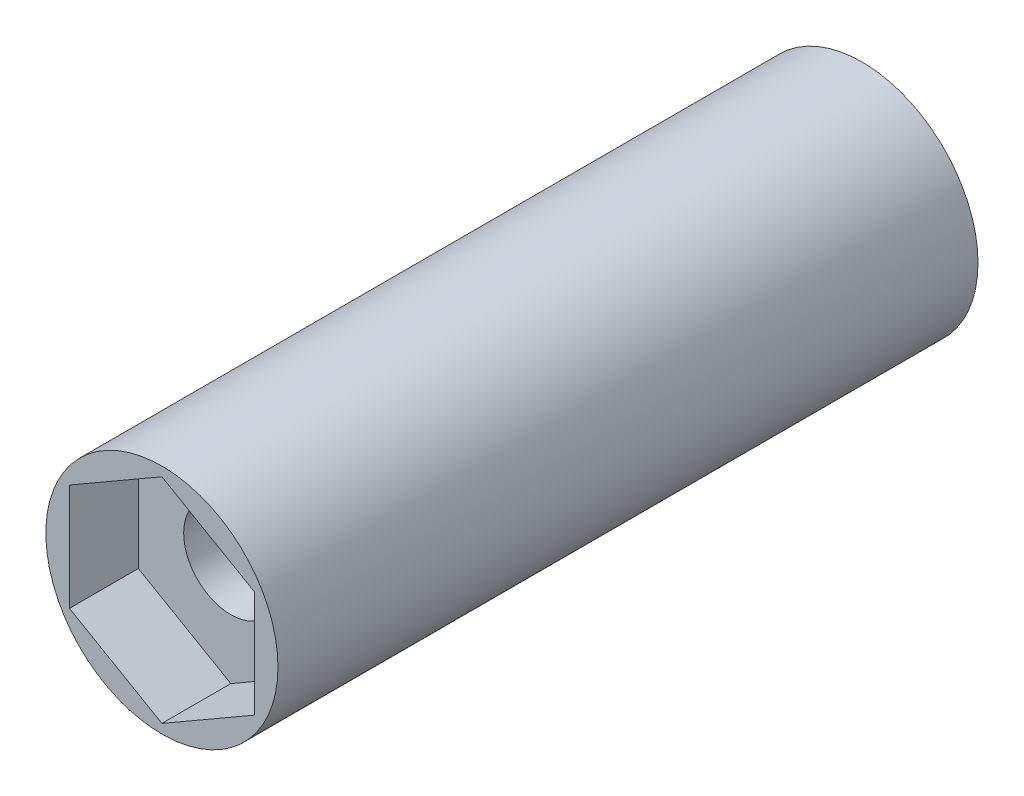
ISO-10303-21;
HEADER;
FILE_DESCRIPTION(('STEP AP214'),'2;1');
FILE_NAME('part.step','',(''),(''),'','','');
FILE_SCHEMA(('AUTOMOTIVE_DESIGN { 1 0 10303 214 1 1 1 1 }'));
ENDSEC;
DATA;
#1=APPLICATION_CONTEXT('core data for automotive mechanical design processes');
#2=APPLICATION_PROTOCOL_DEFINITION('international standard','automotive_design',2000,#1);
#3=PRODUCT_CONTEXT('',#1,'mechanical');
#4=PRODUCT('Part','Part','',(#3));
#5=PRODUCT_RELATED_PRODUCT_CATEGORY('part','',(#4));
#6=PRODUCT_DEFINITION_FORMATION('','',#4);
#7=PRODUCT_DEFINITION_CONTEXT('part definition',#1,'design');
#8=PRODUCT_DEFINITION('design','',#6,#7);
#9=PRODUCT_DEFINITION_SHAPE('','',#8);
#10=(LENGTH_UNIT() NAMED_UNIT(*) SI_UNIT(.MILLI.,.METRE.));
#11=(NAMED_UNIT(*) PLANE_ANGLE_UNIT() SI_UNIT($,.RADIAN.));
#12=(NAMED_UNIT(*) SI_UNIT($,.STERADIAN.) SOLID_ANGLE_UNIT());
#13=UNCERTAINTY_MEASURE_WITH_UNIT(LENGTH_MEASURE(1.E-05),#10,'distance_accuracy_value','');
#14=(GEOMETRIC_REPRESENTATION_CONTEXT(3) GLOBAL_UNCERTAINTY_ASSIGNED_CONTEXT((#13)) GLOBAL_UNIT_ASSIGNED_CONTEXT((#10,
#11,#12)) REPRESENTATION_CONTEXT('',''));
#15=CARTESIAN_POINT('',(0.,0.,0.));
#16=DIRECTION('',(0.,0.,1.));
#17=DIRECTION('',(1.,0.,0.));
#18=AXIS2_PLACEMENT_3D('',#15,#16,#17);
#19=CARTESIAN_POINT('',(-32.2,44.45,26.4509667991878));
#20=DIRECTION('',(0.,0.,-1.));
#21=DIRECTION('',(-1.,0.,0.));
#22=AXIS2_PLACEMENT_3D('',#19,#20,#21);
#23=CYLINDRICAL_SURFACE('',#22,1.3);
#24=CARTESIAN_POINT('',(-32.2,44.45,17.4));
#25=DIRECTION('',(0.,0.,1.));
#26=DIRECTION('',(1.,0.,0.));
#27=AXIS2_PLACEMENT_3D('',#24,#25,#26);
#28=CIRCLE('',#27,1.3);
#29=CARTESIAN_POINT('',(-30.9,44.45,17.4));
#30=VERTEX_POINT('',#29);
#31=EDGE_CURVE('E128',#30,#30,#28,.T.);
#32=ORIENTED_EDGE('',*,*,#31,.T.);
#33=EDGE_LOOP('',(#32));
#34=FACE_BOUND('',#33,.T.);
#35=CARTESIAN_POINT('',(-32.2,44.45,2.4));
#36=DIRECTION('',(0.,0.,-1.));
#37=DIRECTION('',(-1.,0.,0.));
#38=AXIS2_PLACEMENT_3D('',#35,#36,#37);
#39=CIRCLE('',#38,1.3);
#40=CARTESIAN_POINT('',(-33.5,44.45,2.4));
#41=VERTEX_POINT('',#40);
#42=EDGE_CURVE('E110',#41,#41,#39,.T.);
#43=ORIENTED_EDGE('',*,*,#42,.T.);
#44=EDGE_LOOP('',(#43));
#45=FACE_BOUND('',#44,.T.);
#46=ADVANCED_FACE('F37',(#34,#45),#23,.F.);
#47=CARTESIAN_POINT('',(-32.2,44.45,0.));
#48=DIRECTION('',(0.,0.,1.));
#49=DIRECTION('',(1.,0.,0.));
#50=AXIS2_PLACEMENT_3D('',#47,#48,#49);
#51=PLANE('',#50);
#52=CARTESIAN_POINT('',(-32.2,44.45,0.));
#53=DIRECTION('',(0.,0.,1.));
#54=DIRECTION('',(1.,0.,0.));
#55=AXIS2_PLACEMENT_3D('',#52,#53,#54);
#56=CIRCLE('',#55,3.2);
#57=CARTESIAN_POINT('',(-29.,44.45,0.));
#58=VERTEX_POINT('',#57);
#59=EDGE_CURVE('E11',#58,#58,#56,.T.);
#60=ORIENTED_EDGE('',*,*,#59,.F.);
#61=EDGE_LOOP('',(#60));
#62=FACE_BOUND('',#61,.T.);
#63=CARTESIAN_POINT('',(-32.2,44.45,0.));
#64=DIRECTION('',(0.,0.,1.));
#65=DIRECTION('',(1.,0.,0.));
#66=AXIS2_PLACEMENT_3D('',#63,#64,#65);
#67=CIRCLE('',#66,2.92901631902917);
#68=CARTESIAN_POINT('',(-29.2709836809709,44.45,0.));
#69=VERTEX_POINT('',#68);
#70=EDGE_CURVE('E45',#69,#69,#67,.T.);
#71=ORIENTED_EDGE('',*,*,#70,.T.);
#72=EDGE_LOOP('',(#71));
#73=FACE_BOUND('',#72,.T.);
#74=ADVANCED_FACE('F136',(#62,#73),#51,.F.);
#75=CARTESIAN_POINT('',(-32.2,44.45,2.2));
#76=DIRECTION('',(0.,0.,-1.));
#77=DIRECTION('',(-1.,0.,0.));
#78=AXIS2_PLACEMENT_3D('',#75,#76,#77);
#79=CYLINDRICAL_SURFACE('',#78,3.2);
#80=ORIENTED_EDGE('',*,*,#59,.T.);
#81=EDGE_LOOP('',(#80));
#82=FACE_BOUND('',#81,.T.);
#83=CARTESIAN_POINT('',(-32.2,44.45,19.3));
#84=DIRECTION('',(0.,0.,1.));
#85=DIRECTION('',(1.,0.,0.));
#86=AXIS2_PLACEMENT_3D('',#83,#84,#85);
#87=CIRCLE('',#86,3.2);
#88=CARTESIAN_POINT('',(-29.,44.45,19.3));
#89=VERTEX_POINT('',#88);
#90=EDGE_CURVE('E100',#89,#89,#87,.T.);
#91=ORIENTED_EDGE('',*,*,#90,.F.);
#92=EDGE_LOOP('',(#91));
#93=FACE_BOUND('',#92,.T.);
#94=ADVANCED_FACE('F39',(#82,#93),#79,.T.);
#95=CARTESIAN_POINT('',(-32.2,44.45,2.2));
#96=DIRECTION('',(0.,0.,-1.));
#97=DIRECTION('',(-1.,0.,0.));
#98=AXIS2_PLACEMENT_3D('',#95,#96,#97);
#99=CYLINDRICAL_SURFACE('',#98,2.92901631902917);
#100=CARTESIAN_POINT('',(-32.2,44.45,2.2));
#101=DIRECTION('',(0.,0.,1.));
#102=DIRECTION('',(1.,0.,0.));
#103=AXIS2_PLACEMENT_3D('',#100,#101,#102);
#104=CIRCLE('',#103,2.92901631902917);
#105=CARTESIAN_POINT('',(-29.2709836809709,44.45,2.2));
#106=VERTEX_POINT('',#105);
#107=EDGE_CURVE('E131',#106,#106,#104,.T.);
#108=ORIENTED_EDGE('',*,*,#107,.T.);
#109=EDGE_LOOP('',(#108));
#110=FACE_BOUND('',#109,.T.);
#111=ORIENTED_EDGE('',*,*,#70,.F.);
#112=EDGE_LOOP('',(#111));
#113=FACE_BOUND('',#112,.T.);
#114=ADVANCED_FACE('F138',(#110,#113),#99,.F.);
#115=CARTESIAN_POINT('',(-32.2,44.45,2.2));
#116=DIRECTION('',(0.,0.,1.));
#117=DIRECTION('',(1.,0.,0.));
#118=AXIS2_PLACEMENT_3D('',#115,#116,#117);
#119=PLANE('',#118);
#120=ORIENTED_EDGE('',*,*,#107,.F.);
#121=EDGE_LOOP('',(#120));
#122=FACE_BOUND('',#121,.T.);
#123=ADVANCED_FACE('F140',(#122),#119,.F.);
#124=CARTESIAN_POINT('',(-32.2,44.45,17.4));
#125=DIRECTION('',(0.,0.,1.));
#126=DIRECTION('',(0.,-1.,0.));
#127=AXIS2_PLACEMENT_3D('',#124,#125,#126);
#128=PLANE('',#127);
#129=DIRECTION('',(-0.866025403784438,-0.500000000000002,0.));
#130=VECTOR('',#129,1.);
#131=CARTESIAN_POINT('',(-32.2,47.3944863728671,17.4));
#132=LINE('',#131,#130);
#133=CARTESIAN_POINT('',(-32.2,47.3944863728671,17.4));
#134=VERTEX_POINT('',#133);
#135=CARTESIAN_POINT('',(-34.75,45.9222431864335,17.4));
#136=VERTEX_POINT('',#135);
#137=EDGE_CURVE('E113',#134,#136,#132,.T.);
#138=ORIENTED_EDGE('',*,*,#137,.T.);
#139=DIRECTION('',(0.,-1.,0.));
#140=VECTOR('',#139,1.);
#141=CARTESIAN_POINT('',(-34.75,45.9222431864335,17.4));
#142=LINE('',#141,#140);
#143=CARTESIAN_POINT('',(-34.75,42.9777568135665,17.4));
#144=VERTEX_POINT('',#143);
#145=EDGE_CURVE('E203',#136,#144,#142,.T.);
#146=ORIENTED_EDGE('',*,*,#145,.T.);
#147=DIRECTION('',(0.866025403784438,-0.500000000000002,0.));
#148=VECTOR('',#147,1.);
#149=CARTESIAN_POINT('',(-34.75,42.9777568135665,17.4));
#150=LINE('',#149,#148);
#151=CARTESIAN_POINT('',(-32.2,41.5055136271329,17.4));
#152=VERTEX_POINT('',#151);
#153=EDGE_CURVE('E207',#144,#152,#150,.T.);
#154=ORIENTED_EDGE('',*,*,#153,.T.);
#155=DIRECTION('',(0.866025403784438,0.5,0.));
#156=VECTOR('',#155,1.);
#157=CARTESIAN_POINT('',(-32.2,41.5055136271329,17.4));
#158=LINE('',#157,#156);
#159=CARTESIAN_POINT('',(-29.65,42.9777568135665,17.4));
#160=VERTEX_POINT('',#159);
#161=EDGE_CURVE('E209',#152,#160,#158,.T.);
#162=ORIENTED_EDGE('',*,*,#161,.T.);
#163=DIRECTION('',(0.,1.,0.));
#164=VECTOR('',#163,1.);
#165=CARTESIAN_POINT('',(-29.65,42.9777568135665,17.4));
#166=LINE('',#165,#164);
#167=CARTESIAN_POINT('',(-29.65,45.9222431864335,17.4));
#168=VERTEX_POINT('',#167);
#169=EDGE_CURVE('E57',#160,#168,#166,.T.);
#170=ORIENTED_EDGE('',*,*,#169,.T.);
#171=DIRECTION('',(-0.866025403784438,0.5,0.));
#172=VECTOR('',#171,1.);
#173=CARTESIAN_POINT('',(-29.65,45.9222431864335,17.4));
#174=LINE('',#173,#172);
#175=EDGE_CURVE('E52',#168,#134,#174,.T.);
#176=ORIENTED_EDGE('',*,*,#175,.T.);
#177=EDGE_LOOP('',(#138,#146,#154,#162,#170,#176));
#178=FACE_BOUND('',#177,.T.);
#179=ORIENTED_EDGE('',*,*,#31,.F.);
#180=EDGE_LOOP('',(#179));
#181=FACE_BOUND('',#180,.T.);
#182=ADVANCED_FACE('F148',(#178,#181),#128,.T.);
#183=CARTESIAN_POINT('',(-32.2,47.3944863728671,28.3509667991878));
#184=DIRECTION('',(0.500000000000002,-0.866025403784438,0.));
#185=DIRECTION('',(0.866025403784438,0.500000000000002,0.));
#186=AXIS2_PLACEMENT_3D('',#183,#184,#185);
#187=PLANE('',#186);
#188=DIRECTION('',(0.,0.,-1.));
#189=VECTOR('',#188,1.);
#190=CARTESIAN_POINT('',(-32.2,47.3944863728671,28.3509667991878));
#191=LINE('',#190,#189);
#192=CARTESIAN_POINT('',(-32.2,47.3944863728671,19.3));
#193=VERTEX_POINT('',#192);
#194=EDGE_CURVE('E105',#193,#134,#191,.T.);
#195=ORIENTED_EDGE('',*,*,#194,.F.);
#196=DIRECTION('',(-0.866025403784438,-0.500000000000002,0.));
#197=VECTOR('',#196,1.);
#198=CARTESIAN_POINT('',(-32.2,47.3944863728671,19.3));
#199=LINE('',#198,#197);
#200=CARTESIAN_POINT('',(-34.75,45.9222431864335,19.3));
#201=VERTEX_POINT('',#200);
#202=EDGE_CURVE('E88',#193,#201,#199,.T.);
#203=ORIENTED_EDGE('',*,*,#202,.T.);
#204=DIRECTION('',(0.,0.,-1.));
#205=VECTOR('',#204,1.);
#206=CARTESIAN_POINT('',(-34.75,45.9222431864335,28.3509667991878));
#207=LINE('',#206,#205);
#208=EDGE_CURVE('E114',#201,#136,#207,.T.);
#209=ORIENTED_EDGE('',*,*,#208,.T.);
#210=ORIENTED_EDGE('',*,*,#137,.F.);
#211=EDGE_LOOP('',(#195,#203,#209,#210));
#212=FACE_BOUND('',#211,.T.);
#213=ADVANCED_FACE('F112',(#212),#187,.T.);
#214=CARTESIAN_POINT('',(-29.65,45.9222431864335,28.3509667991878));
#215=DIRECTION('',(-0.5,-0.866025403784438,0.));
#216=DIRECTION('',(0.866025403784438,-0.5,0.));
#217=AXIS2_PLACEMENT_3D('',#214,#215,#216);
#218=PLANE('',#217);
#219=DIRECTION('',(0.,0.,-1.));
#220=VECTOR('',#219,1.);
#221=CARTESIAN_POINT('',(-29.65,45.9222431864335,28.3509667991878));
#222=LINE('',#221,#220);
#223=CARTESIAN_POINT('',(-29.65,45.9222431864335,19.3));
#224=VERTEX_POINT('',#223);
#225=EDGE_CURVE('E107',#224,#168,#222,.T.);
#226=ORIENTED_EDGE('',*,*,#225,.F.);
#227=DIRECTION('',(-0.866025403784438,0.5,0.));
#228=VECTOR('',#227,1.);
#229=CARTESIAN_POINT('',(-29.65,45.9222431864335,19.3));
#230=LINE('',#229,#228);
#231=EDGE_CURVE('E92',#224,#193,#230,.T.);
#232=ORIENTED_EDGE('',*,*,#231,.T.);
#233=ORIENTED_EDGE('',*,*,#194,.T.);
#234=ORIENTED_EDGE('',*,*,#175,.F.);
#235=EDGE_LOOP('',(#226,#232,#233,#234));
#236=FACE_BOUND('',#235,.T.);
#237=ADVANCED_FACE('F104',(#236),#218,.T.);
#238=CARTESIAN_POINT('',(-29.65,42.9777568135665,28.3509667991878));
#239=DIRECTION('',(-1.,0.,0.));
#240=DIRECTION('',(0.,0.,1.));
#241=AXIS2_PLACEMENT_3D('',#238,#239,#240);
#242=PLANE('',#241);
#243=DIRECTION('',(0.,0.,-1.));
#244=VECTOR('',#243,1.);
#245=CARTESIAN_POINT('',(-29.65,42.9777568135665,28.3509667991878));
#246=LINE('',#245,#244);
#247=CARTESIAN_POINT('',(-29.65,42.9777568135665,19.3));
#248=VERTEX_POINT('',#247);
#249=EDGE_CURVE('E116',#248,#160,#246,.T.);
#250=ORIENTED_EDGE('',*,*,#249,.F.);
#251=DIRECTION('',(0.,1.,0.));
#252=VECTOR('',#251,1.);
#253=CARTESIAN_POINT('',(-29.65,42.9777568135665,19.3));
#254=LINE('',#253,#252);
#255=EDGE_CURVE('E109',#248,#224,#254,.T.);
#256=ORIENTED_EDGE('',*,*,#255,.T.);
#257=ORIENTED_EDGE('',*,*,#225,.T.);
#258=ORIENTED_EDGE('',*,*,#169,.F.);
#259=EDGE_LOOP('',(#250,#256,#257,#258));
#260=FACE_BOUND('',#259,.T.);
#261=ADVANCED_FACE('F175',(#260),#242,.T.);
#262=CARTESIAN_POINT('',(-32.2,41.5055136271329,28.3509667991878));
#263=DIRECTION('',(-0.5,0.866025403784438,0.));
#264=DIRECTION('',(-0.866025403784438,-0.5,0.));
#265=AXIS2_PLACEMENT_3D('',#262,#263,#264);
#266=PLANE('',#265);
#267=DIRECTION('',(0.,0.,-1.));
#268=VECTOR('',#267,1.);
#269=CARTESIAN_POINT('',(-32.2,41.5055136271329,28.3509667991878));
#270=LINE('',#269,#268);
#271=CARTESIAN_POINT('',(-32.2,41.5055136271329,19.3));
#272=VERTEX_POINT('',#271);
#273=EDGE_CURVE('E123',#272,#152,#270,.T.);
#274=ORIENTED_EDGE('',*,*,#273,.F.);
#275=DIRECTION('',(0.866025403784438,0.5,0.));
#276=VECTOR('',#275,1.);
#277=CARTESIAN_POINT('',(-32.2,41.5055136271329,19.3));
#278=LINE('',#277,#276);
#279=EDGE_CURVE('E196',#272,#248,#278,.T.);
#280=ORIENTED_EDGE('',*,*,#279,.T.);
#281=ORIENTED_EDGE('',*,*,#249,.T.);
#282=ORIENTED_EDGE('',*,*,#161,.F.);
#283=EDGE_LOOP('',(#274,#280,#281,#282));
#284=FACE_BOUND('',#283,.T.);
#285=ADVANCED_FACE('F171',(#284),#266,.T.);
#286=CARTESIAN_POINT('',(-34.75,42.9777568135665,28.3509667991878));
#287=DIRECTION('',(0.500000000000002,0.866025403784438,0.));
#288=DIRECTION('',(-0.866025403784438,0.500000000000002,0.));
#289=AXIS2_PLACEMENT_3D('',#286,#287,#288);
#290=PLANE('',#289);
#291=DIRECTION('',(0.,0.,-1.));
#292=VECTOR('',#291,1.);
#293=CARTESIAN_POINT('',(-34.75,42.9777568135665,28.3509667991878));
#294=LINE('',#293,#292);
#295=CARTESIAN_POINT('',(-34.75,42.9777568135665,19.3));
#296=VERTEX_POINT('',#295);
#297=EDGE_CURVE('E101',#296,#144,#294,.T.);
#298=ORIENTED_EDGE('',*,*,#297,.F.);
#299=DIRECTION('',(0.866025403784438,-0.500000000000002,0.));
#300=VECTOR('',#299,1.);
#301=CARTESIAN_POINT('',(-34.75,42.9777568135665,19.3));
#302=LINE('',#301,#300);
#303=EDGE_CURVE('E199',#296,#272,#302,.T.);
#304=ORIENTED_EDGE('',*,*,#303,.T.);
#305=ORIENTED_EDGE('',*,*,#273,.T.);
#306=ORIENTED_EDGE('',*,*,#153,.F.);
#307=EDGE_LOOP('',(#298,#304,#305,#306));
#308=FACE_BOUND('',#307,.T.);
#309=ADVANCED_FACE('F167',(#308),#290,.T.);
#310=CARTESIAN_POINT('',(-34.75,45.9222431864335,28.3509667991878));
#311=DIRECTION('',(1.,0.,0.));
#312=DIRECTION('',(0.,0.,-1.));
#313=AXIS2_PLACEMENT_3D('',#310,#311,#312);
#314=PLANE('',#313);
#315=ORIENTED_EDGE('',*,*,#208,.F.);
#316=DIRECTION('',(0.,-1.,0.));
#317=VECTOR('',#316,1.);
#318=CARTESIAN_POINT('',(-34.75,45.9222431864335,19.3));
#319=LINE('',#318,#317);
#320=EDGE_CURVE('E95',#201,#296,#319,.T.);
#321=ORIENTED_EDGE('',*,*,#320,.T.);
#322=ORIENTED_EDGE('',*,*,#297,.T.);
#323=ORIENTED_EDGE('',*,*,#145,.F.);
#324=EDGE_LOOP('',(#315,#321,#322,#323));
#325=FACE_BOUND('',#324,.T.);
#326=ADVANCED_FACE('F164',(#325),#314,.T.);
#327=CARTESIAN_POINT('',(-32.2,44.45,19.3));
#328=DIRECTION('',(0.,0.,1.));
#329=DIRECTION('',(0.,-1.,0.));
#330=AXIS2_PLACEMENT_3D('',#327,#328,#329);
#331=PLANE('',#330);
#332=ORIENTED_EDGE('',*,*,#320,.F.);
#333=ORIENTED_EDGE('',*,*,#202,.F.);
#334=ORIENTED_EDGE('',*,*,#231,.F.);
#335=ORIENTED_EDGE('',*,*,#255,.F.);
#336=ORIENTED_EDGE('',*,*,#279,.F.);
#337=ORIENTED_EDGE('',*,*,#303,.F.);
#338=EDGE_LOOP('',(#332,#333,#334,#335,#336,#337));
#339=FACE_BOUND('',#338,.T.);
#340=ORIENTED_EDGE('',*,*,#90,.T.);
#341=EDGE_LOOP('',(#340));
#342=FACE_BOUND('',#341,.T.);
#343=ADVANCED_FACE('F90',(#339,#342),#331,.T.);
#344=CARTESIAN_POINT('',(-32.2,44.45,2.4));
#345=DIRECTION('',(0.,0.,-1.));
#346=DIRECTION('',(-1.,0.,0.));
#347=AXIS2_PLACEMENT_3D('',#344,#345,#346);
#348=PLANE('',#347);
#349=ORIENTED_EDGE('',*,*,#42,.F.);
#350=EDGE_LOOP('',(#349));
#351=FACE_BOUND('',#350,.T.);
#352=ADVANCED_FACE('F186',(#351),#348,.F.);
#353=CLOSED_SHELL('',(#46,#74,#94,#114,#123,#182,#213,#237,#261,#285,#309,#326,#343,#352));
#354=MANIFOLD_SOLID_BREP('B2',#353);
#355=ADVANCED_BREP_SHAPE_REPRESENTATION('',(#18,#354),#14);
#356=SHAPE_DEFINITION_REPRESENTATION(#9,#355);
ENDSEC;
END-ISO-10303-21;
